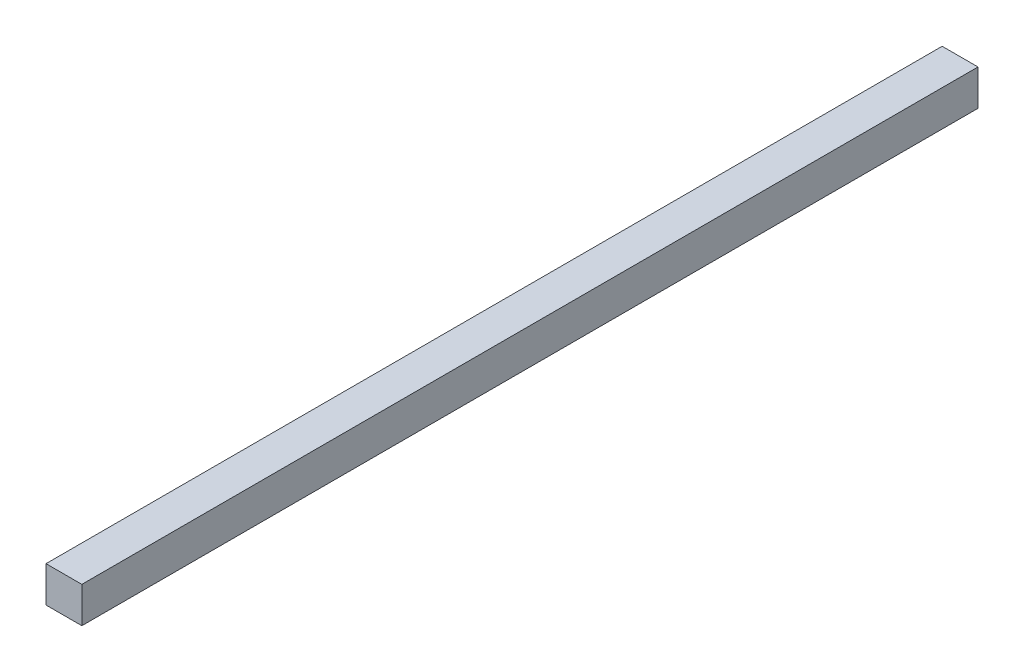
ISO-10303-21;
HEADER;
FILE_DESCRIPTION(('STEP AP214'),'2;1');
FILE_NAME('part.step','',(''),(''),'','','');
FILE_SCHEMA(('AUTOMOTIVE_DESIGN { 1 0 10303 214 1 1 1 1 }'));
ENDSEC;
DATA;
#1=APPLICATION_CONTEXT('core data for automotive mechanical design processes');
#2=APPLICATION_PROTOCOL_DEFINITION('international standard','automotive_design',2000,#1);
#3=PRODUCT_CONTEXT('',#1,'mechanical');
#4=PRODUCT('Part','Part','',(#3));
#5=PRODUCT_RELATED_PRODUCT_CATEGORY('part','',(#4));
#6=PRODUCT_DEFINITION_FORMATION('','',#4);
#7=PRODUCT_DEFINITION_CONTEXT('part definition',#1,'design');
#8=PRODUCT_DEFINITION('design','',#6,#7);
#9=PRODUCT_DEFINITION_SHAPE('','',#8);
#10=(LENGTH_UNIT() NAMED_UNIT(*) SI_UNIT(.MILLI.,.METRE.));
#11=(NAMED_UNIT(*) PLANE_ANGLE_UNIT() SI_UNIT($,.RADIAN.));
#12=(NAMED_UNIT(*) SI_UNIT($,.STERADIAN.) SOLID_ANGLE_UNIT());
#13=UNCERTAINTY_MEASURE_WITH_UNIT(LENGTH_MEASURE(1.E-05),#10,'distance_accuracy_value','');
#14=(GEOMETRIC_REPRESENTATION_CONTEXT(3) GLOBAL_UNCERTAINTY_ASSIGNED_CONTEXT((#13)) GLOBAL_UNIT_ASSIGNED_CONTEXT((#10,
#11,#12)) REPRESENTATION_CONTEXT('',''));
#15=CARTESIAN_POINT('',(0.,0.,0.));
#16=DIRECTION('',(0.,0.,1.));
#17=DIRECTION('',(1.,0.,0.));
#18=AXIS2_PLACEMENT_3D('',#15,#16,#17);
#19=CARTESIAN_POINT('',(10.,-10.,500.));
#20=DIRECTION('',(-1.,0.,0.));
#21=DIRECTION('',(0.,0.,1.));
#22=AXIS2_PLACEMENT_3D('',#19,#20,#21);
#23=PLANE('',#22);
#24=DIRECTION('',(0.,1.,0.));
#25=VECTOR('',#24,1.);
#26=CARTESIAN_POINT('',(10.,-10.,0.));
#27=LINE('',#26,#25);
#28=CARTESIAN_POINT('',(10.,-10.,0.));
#29=VERTEX_POINT('',#28);
#30=CARTESIAN_POINT('',(10.,10.,0.));
#31=VERTEX_POINT('',#30);
#32=EDGE_CURVE('E98',#29,#31,#27,.T.);
#33=ORIENTED_EDGE('',*,*,#32,.T.);
#34=DIRECTION('',(0.,0.,-1.));
#35=VECTOR('',#34,1.);
#36=CARTESIAN_POINT('',(10.,10.,500.));
#37=LINE('',#36,#35);
#38=CARTESIAN_POINT('',(10.,10.,500.));
#39=VERTEX_POINT('',#38);
#40=EDGE_CURVE('E11',#39,#31,#37,.T.);
#41=ORIENTED_EDGE('',*,*,#40,.F.);
#42=DIRECTION('',(0.,1.,0.));
#43=VECTOR('',#42,1.);
#44=CARTESIAN_POINT('',(10.,-10.,500.));
#45=LINE('',#44,#43);
#46=CARTESIAN_POINT('',(10.,-10.,500.));
#47=VERTEX_POINT('',#46);
#48=EDGE_CURVE('E86',#47,#39,#45,.T.);
#49=ORIENTED_EDGE('',*,*,#48,.F.);
#50=DIRECTION('',(0.,0.,-1.));
#51=VECTOR('',#50,1.);
#52=CARTESIAN_POINT('',(10.,-10.,500.));
#53=LINE('',#52,#51);
#54=EDGE_CURVE('E94',#47,#29,#53,.T.);
#55=ORIENTED_EDGE('',*,*,#54,.T.);
#56=EDGE_LOOP('',(#33,#41,#49,#55));
#57=FACE_BOUND('',#56,.T.);
#58=ADVANCED_FACE('F35',(#57),#23,.F.);
#59=CARTESIAN_POINT('',(-10.,10.,500.));
#60=DIRECTION('',(0.,-1.,0.));
#61=DIRECTION('',(0.,0.,-1.));
#62=AXIS2_PLACEMENT_3D('',#59,#60,#61);
#63=PLANE('',#62);
#64=DIRECTION('',(-1.,0.,0.));
#65=VECTOR('',#64,1.);
#66=CARTESIAN_POINT('',(-10.,10.,0.));
#67=LINE('',#66,#65);
#68=CARTESIAN_POINT('',(-10.,10.,0.));
#69=VERTEX_POINT('',#68);
#70=EDGE_CURVE('E90',#31,#69,#67,.T.);
#71=ORIENTED_EDGE('',*,*,#70,.T.);
#72=DIRECTION('',(0.,0.,-1.));
#73=VECTOR('',#72,1.);
#74=CARTESIAN_POINT('',(-10.,10.,500.));
#75=LINE('',#74,#73);
#76=CARTESIAN_POINT('',(-10.,10.,500.));
#77=VERTEX_POINT('',#76);
#78=EDGE_CURVE('E43',#77,#69,#75,.T.);
#79=ORIENTED_EDGE('',*,*,#78,.F.);
#80=DIRECTION('',(-1.,0.,0.));
#81=VECTOR('',#80,1.);
#82=CARTESIAN_POINT('',(-10.,10.,500.));
#83=LINE('',#82,#81);
#84=EDGE_CURVE('E81',#39,#77,#83,.T.);
#85=ORIENTED_EDGE('',*,*,#84,.F.);
#86=ORIENTED_EDGE('',*,*,#40,.T.);
#87=EDGE_LOOP('',(#71,#79,#85,#86));
#88=FACE_BOUND('',#87,.T.);
#89=ADVANCED_FACE('F89',(#88),#63,.F.);
#90=CARTESIAN_POINT('',(-10.,-10.,500.));
#91=DIRECTION('',(1.,0.,0.));
#92=DIRECTION('',(0.,0.,-1.));
#93=AXIS2_PLACEMENT_3D('',#90,#91,#92);
#94=PLANE('',#93);
#95=DIRECTION('',(0.,-1.,0.));
#96=VECTOR('',#95,1.);
#97=CARTESIAN_POINT('',(-10.,-10.,0.));
#98=LINE('',#97,#96);
#99=CARTESIAN_POINT('',(-10.,-10.,0.));
#100=VERTEX_POINT('',#99);
#101=EDGE_CURVE('E68',#69,#100,#98,.T.);
#102=ORIENTED_EDGE('',*,*,#101,.T.);
#103=DIRECTION('',(0.,0.,-1.));
#104=VECTOR('',#103,1.);
#105=CARTESIAN_POINT('',(-10.,-10.,500.));
#106=LINE('',#105,#104);
#107=CARTESIAN_POINT('',(-10.,-10.,500.));
#108=VERTEX_POINT('',#107);
#109=EDGE_CURVE('E91',#108,#100,#106,.T.);
#110=ORIENTED_EDGE('',*,*,#109,.F.);
#111=DIRECTION('',(0.,-1.,0.));
#112=VECTOR('',#111,1.);
#113=CARTESIAN_POINT('',(-10.,-10.,500.));
#114=LINE('',#113,#112);
#115=EDGE_CURVE('E84',#77,#108,#114,.T.);
#116=ORIENTED_EDGE('',*,*,#115,.F.);
#117=ORIENTED_EDGE('',*,*,#78,.T.);
#118=EDGE_LOOP('',(#102,#110,#116,#117));
#119=FACE_BOUND('',#118,.T.);
#120=ADVANCED_FACE('F92',(#119),#94,.F.);
#121=CARTESIAN_POINT('',(-10.,-10.,500.));
#122=DIRECTION('',(0.,1.,0.));
#123=DIRECTION('',(0.,0.,1.));
#124=AXIS2_PLACEMENT_3D('',#121,#122,#123);
#125=PLANE('',#124);
#126=DIRECTION('',(1.,0.,0.));
#127=VECTOR('',#126,1.);
#128=CARTESIAN_POINT('',(-10.,-10.,0.));
#129=LINE('',#128,#127);
#130=EDGE_CURVE('E74',#100,#29,#129,.T.);
#131=ORIENTED_EDGE('',*,*,#130,.T.);
#132=ORIENTED_EDGE('',*,*,#54,.F.);
#133=DIRECTION('',(1.,0.,0.));
#134=VECTOR('',#133,1.);
#135=CARTESIAN_POINT('',(-10.,-10.,500.));
#136=LINE('',#135,#134);
#137=EDGE_CURVE('E51',#108,#47,#136,.T.);
#138=ORIENTED_EDGE('',*,*,#137,.F.);
#139=ORIENTED_EDGE('',*,*,#109,.T.);
#140=EDGE_LOOP('',(#131,#132,#138,#139));
#141=FACE_BOUND('',#140,.T.);
#142=ADVANCED_FACE('F105',(#141),#125,.F.);
#143=CARTESIAN_POINT('',(0.,0.,500.));
#144=DIRECTION('',(0.,0.,-1.));
#145=DIRECTION('',(-1.,0.,0.));
#146=AXIS2_PLACEMENT_3D('',#143,#144,#145);
#147=PLANE('',#146);
#148=ORIENTED_EDGE('',*,*,#48,.T.);
#149=ORIENTED_EDGE('',*,*,#84,.T.);
#150=ORIENTED_EDGE('',*,*,#115,.T.);
#151=ORIENTED_EDGE('',*,*,#137,.T.);
#152=EDGE_LOOP('',(#148,#149,#150,#151));
#153=FACE_BOUND('',#152,.T.);
#154=ADVANCED_FACE('F82',(#153),#147,.F.);
#155=CARTESIAN_POINT('',(0.,0.,0.));
#156=DIRECTION('',(0.,0.,-1.));
#157=DIRECTION('',(-1.,0.,0.));
#158=AXIS2_PLACEMENT_3D('',#155,#156,#157);
#159=PLANE('',#158);
#160=ORIENTED_EDGE('',*,*,#32,.F.);
#161=ORIENTED_EDGE('',*,*,#130,.F.);
#162=ORIENTED_EDGE('',*,*,#101,.F.);
#163=ORIENTED_EDGE('',*,*,#70,.F.);
#164=EDGE_LOOP('',(#160,#161,#162,#163));
#165=FACE_BOUND('',#164,.T.);
#166=ADVANCED_FACE('F108',(#165),#159,.T.);
#167=CLOSED_SHELL('',(#58,#89,#120,#142,#154,#166));
#168=MANIFOLD_SOLID_BREP('B2',#167);
#169=ADVANCED_BREP_SHAPE_REPRESENTATION('',(#18,#168),#14);
#170=SHAPE_DEFINITION_REPRESENTATION(#9,#169);
ENDSEC;
END-ISO-10303-21;
